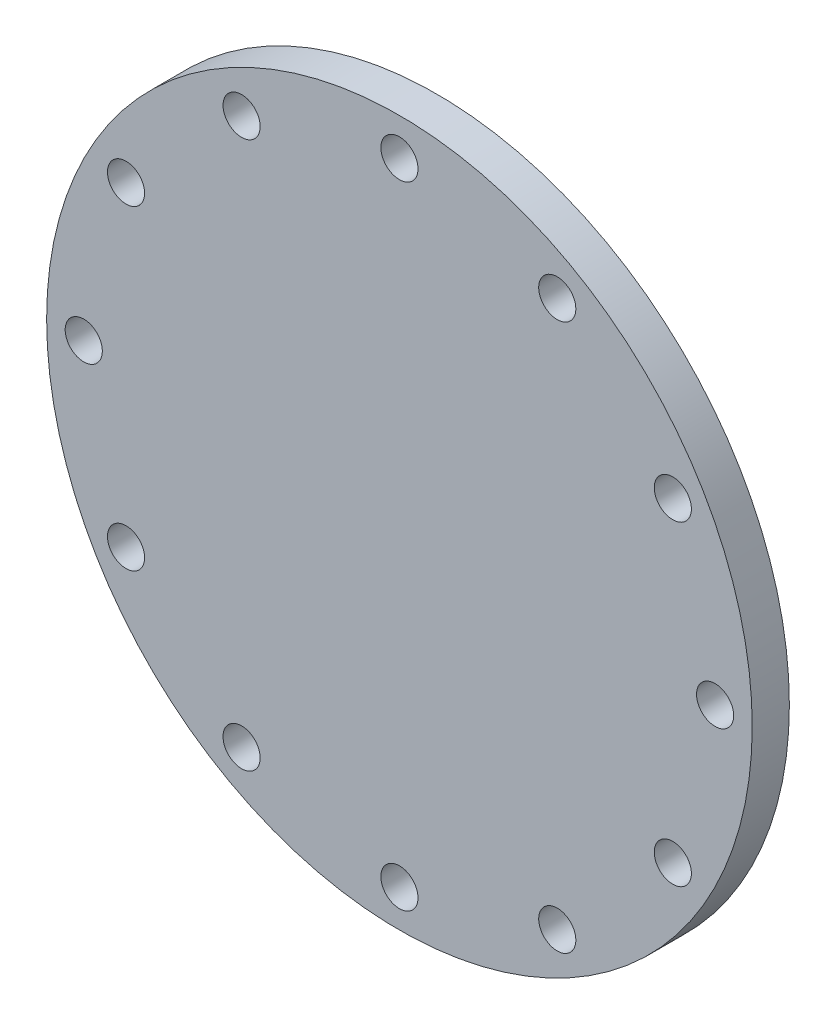
ISO-10303-21;
HEADER;
FILE_DESCRIPTION(('STEP AP214'),'2;1');
FILE_NAME('part.step','',(''),(''),'','','');
FILE_SCHEMA(('AUTOMOTIVE_DESIGN { 1 0 10303 214 1 1 1 1 }'));
ENDSEC;
DATA;
#1=APPLICATION_CONTEXT('core data for automotive mechanical design processes');
#2=APPLICATION_PROTOCOL_DEFINITION('international standard','automotive_design',2000,#1);
#3=PRODUCT_CONTEXT('',#1,'mechanical');
#4=PRODUCT('Part','Part','',(#3));
#5=PRODUCT_RELATED_PRODUCT_CATEGORY('part','',(#4));
#6=PRODUCT_DEFINITION_FORMATION('','',#4);
#7=PRODUCT_DEFINITION_CONTEXT('part definition',#1,'design');
#8=PRODUCT_DEFINITION('design','',#6,#7);
#9=PRODUCT_DEFINITION_SHAPE('','',#8);
#10=(LENGTH_UNIT() NAMED_UNIT(*) SI_UNIT(.MILLI.,.METRE.));
#11=(NAMED_UNIT(*) PLANE_ANGLE_UNIT() SI_UNIT($,.RADIAN.));
#12=(NAMED_UNIT(*) SI_UNIT($,.STERADIAN.) SOLID_ANGLE_UNIT());
#13=UNCERTAINTY_MEASURE_WITH_UNIT(LENGTH_MEASURE(1.E-05),#10,'distance_accuracy_value','');
#14=(GEOMETRIC_REPRESENTATION_CONTEXT(3) GLOBAL_UNCERTAINTY_ASSIGNED_CONTEXT((#13)) GLOBAL_UNIT_ASSIGNED_CONTEXT((#10,
#11,#12)) REPRESENTATION_CONTEXT('',''));
#15=CARTESIAN_POINT('',(0.,0.,0.));
#16=DIRECTION('',(0.,0.,1.));
#17=DIRECTION('',(1.,0.,0.));
#18=AXIS2_PLACEMENT_3D('',#15,#16,#17);
#19=CARTESIAN_POINT('',(0.,0.,25.4));
#20=DIRECTION('',(0.,0.,1.));
#21=DIRECTION('',(1.,0.,0.));
#22=AXIS2_PLACEMENT_3D('',#19,#20,#21);
#23=PLANE('',#22);
#24=CARTESIAN_POINT('',(-186.974884677056,107.949999999992,25.4));
#25=DIRECTION('',(0.,0.,1.));
#26=DIRECTION('',(1.,0.,0.));
#27=AXIS2_PLACEMENT_3D('',#24,#25,#26);
#28=CIRCLE('',#27,12.7000000000093);
#29=CARTESIAN_POINT('',(-174.274884677047,107.949999999992,25.4));
#30=VERTEX_POINT('',#29);
#31=EDGE_CURVE('E106',#30,#30,#28,.T.);
#32=ORIENTED_EDGE('',*,*,#31,.F.);
#33=EDGE_LOOP('',(#32));
#34=FACE_BOUND('',#33,.T.);
#35=CARTESIAN_POINT('',(-186.974884677047,-107.950000000008,25.4));
#36=DIRECTION('',(0.,0.,1.));
#37=DIRECTION('',(1.,0.,0.));
#38=AXIS2_PLACEMENT_3D('',#35,#36,#37);
#39=CIRCLE('',#38,12.7000000000175);
#40=CARTESIAN_POINT('',(-174.274884677029,-107.950000000008,25.4));
#41=VERTEX_POINT('',#40);
#42=EDGE_CURVE('E94',#41,#41,#39,.T.);
#43=ORIENTED_EDGE('',*,*,#42,.F.);
#44=EDGE_LOOP('',(#43));
#45=FACE_BOUND('',#44,.T.);
#46=CARTESIAN_POINT('',(1.83294208248919E-11,-215.9,25.4));
#47=DIRECTION('',(0.,0.,1.));
#48=DIRECTION('',(1.,0.,0.));
#49=AXIS2_PLACEMENT_3D('',#46,#47,#48);
#50=CIRCLE('',#49,12.700000000019);
#51=CARTESIAN_POINT('',(12.7000000000373,-215.9,25.4));
#52=VERTEX_POINT('',#51);
#53=EDGE_CURVE('E82',#52,#52,#50,.T.);
#54=ORIENTED_EDGE('',*,*,#53,.F.);
#55=EDGE_LOOP('',(#54));
#56=FACE_BOUND('',#55,.T.);
#57=CARTESIAN_POINT('',(186.974884677074,-107.949999999992,25.4));
#58=DIRECTION('',(0.,0.,1.));
#59=DIRECTION('',(1.,0.,0.));
#60=AXIS2_PLACEMENT_3D('',#57,#58,#59);
#61=CIRCLE('',#60,12.7000000000118);
#62=CARTESIAN_POINT('',(199.674884677086,-107.949999999992,25.4));
#63=VERTEX_POINT('',#62);
#64=EDGE_CURVE('E70',#63,#63,#61,.T.);
#65=ORIENTED_EDGE('',*,*,#64,.F.);
#66=EDGE_LOOP('',(#65));
#67=FACE_BOUND('',#66,.T.);
#68=CARTESIAN_POINT('',(186.974884677065,107.950000000008,25.4));
#69=DIRECTION('',(0.,0.,1.));
#70=DIRECTION('',(1.,0.,0.));
#71=AXIS2_PLACEMENT_3D('',#68,#69,#70);
#72=CIRCLE('',#71,12.7000000000025);
#73=CARTESIAN_POINT('',(199.674884677067,107.950000000008,25.4));
#74=VERTEX_POINT('',#73);
#75=EDGE_CURVE('E58',#74,#74,#72,.T.);
#76=ORIENTED_EDGE('',*,*,#75,.F.);
#77=EDGE_LOOP('',(#76));
#78=FACE_BOUND('',#77,.T.);
#79=CARTESIAN_POINT('',(0.,215.9,25.4));
#80=DIRECTION('',(0.,0.,1.));
#81=DIRECTION('',(1.,0.,0.));
#82=AXIS2_PLACEMENT_3D('',#79,#80,#81);
#83=CIRCLE('',#82,12.7);
#84=CARTESIAN_POINT('',(12.7,215.9,25.4));
#85=VERTEX_POINT('',#84);
#86=EDGE_CURVE('E47',#85,#85,#83,.T.);
#87=ORIENTED_EDGE('',*,*,#86,.F.);
#88=EDGE_LOOP('',(#87));
#89=FACE_BOUND('',#88,.T.);
#90=CARTESIAN_POINT('',(0.,0.,25.4));
#91=DIRECTION('',(0.,0.,1.));
#92=DIRECTION('',(1.,0.,0.));
#93=AXIS2_PLACEMENT_3D('',#90,#91,#92);
#94=CIRCLE('',#93,241.3);
#95=CARTESIAN_POINT('',(241.3,0.,25.4));
#96=VERTEX_POINT('',#95);
#97=EDGE_CURVE('E10',#96,#96,#94,.T.);
#98=ORIENTED_EDGE('',*,*,#97,.T.);
#99=EDGE_LOOP('',(#98));
#100=FACE_BOUND('',#99,.T.);
#101=CARTESIAN_POINT('',(107.95,186.97488467706,25.4));
#102=DIRECTION('',(0.,0.,1.));
#103=DIRECTION('',(1.,0.,0.));
#104=AXIS2_PLACEMENT_3D('',#101,#102,#103);
#105=CIRCLE('',#104,12.7);
#106=CARTESIAN_POINT('',(120.65,186.97488467706,25.4));
#107=VERTEX_POINT('',#106);
#108=EDGE_CURVE('E52',#107,#107,#105,.T.);
#109=ORIENTED_EDGE('',*,*,#108,.F.);
#110=EDGE_LOOP('',(#109));
#111=FACE_BOUND('',#110,.T.);
#112=CARTESIAN_POINT('',(215.900000000009,9.16471041244595E-12,25.4));
#113=DIRECTION('',(0.,0.,1.));
#114=DIRECTION('',(1.,0.,0.));
#115=AXIS2_PLACEMENT_3D('',#112,#113,#114);
#116=CIRCLE('',#115,12.7000000000068);
#117=CARTESIAN_POINT('',(228.600000000016,9.16471041244595E-12,25.4));
#118=VERTEX_POINT('',#117);
#119=EDGE_CURVE('E64',#118,#118,#116,.T.);
#120=ORIENTED_EDGE('',*,*,#119,.F.);
#121=EDGE_LOOP('',(#120));
#122=FACE_BOUND('',#121,.T.);
#123=CARTESIAN_POINT('',(107.950000000017,-186.974884677056,25.4));
#124=DIRECTION('',(0.,0.,1.));
#125=DIRECTION('',(1.,0.,0.));
#126=AXIS2_PLACEMENT_3D('',#123,#124,#125);
#127=CIRCLE('',#126,12.7000000000163);
#128=CARTESIAN_POINT('',(120.650000000033,-186.974884677056,25.4));
#129=VERTEX_POINT('',#128);
#130=EDGE_CURVE('E76',#129,#129,#127,.T.);
#131=ORIENTED_EDGE('',*,*,#130,.F.);
#132=EDGE_LOOP('',(#131));
#133=FACE_BOUND('',#132,.T.);
#134=CARTESIAN_POINT('',(-107.949999999983,-186.974884677065,25.4));
#135=DIRECTION('',(0.,0.,1.));
#136=DIRECTION('',(1.,0.,0.));
#137=AXIS2_PLACEMENT_3D('',#134,#135,#136);
#138=CIRCLE('',#137,12.7000000000194);
#139=CARTESIAN_POINT('',(-95.2499999999634,-186.974884677065,25.4));
#140=VERTEX_POINT('',#139);
#141=EDGE_CURVE('E88',#140,#140,#138,.T.);
#142=ORIENTED_EDGE('',*,*,#141,.F.);
#143=EDGE_LOOP('',(#142));
#144=FACE_BOUND('',#143,.T.);
#145=CARTESIAN_POINT('',(-215.899999999991,-9.19115053683954E-12,25.4));
#146=DIRECTION('',(0.,0.,1.));
#147=DIRECTION('',(1.,0.,0.));
#148=AXIS2_PLACEMENT_3D('',#145,#146,#147);
#149=CIRCLE('',#148,12.7000000000136);
#150=CARTESIAN_POINT('',(-203.199999999977,-9.19115053683954E-12,25.4));
#151=VERTEX_POINT('',#150);
#152=EDGE_CURVE('E100',#151,#151,#149,.T.);
#153=ORIENTED_EDGE('',*,*,#152,.F.);
#154=EDGE_LOOP('',(#153));
#155=FACE_BOUND('',#154,.T.);
#156=CARTESIAN_POINT('',(-107.949999999999,186.974884677056,25.4));
#157=DIRECTION('',(0.,0.,1.));
#158=DIRECTION('',(1.,0.,0.));
#159=AXIS2_PLACEMENT_3D('',#156,#157,#158);
#160=CIRCLE('',#159,12.7000000000053);
#161=CARTESIAN_POINT('',(-95.2499999999936,186.974884677056,25.4));
#162=VERTEX_POINT('',#161);
#163=EDGE_CURVE('E112',#162,#162,#160,.T.);
#164=ORIENTED_EDGE('',*,*,#163,.F.);
#165=EDGE_LOOP('',(#164));
#166=FACE_BOUND('',#165,.T.);
#167=ADVANCED_FACE('F36',(#34,#45,#56,#67,#78,#89,#100,#111,#122,#133,#144,#155,#166),#23,.T.);
#168=CARTESIAN_POINT('',(0.,0.,0.));
#169=DIRECTION('',(0.,0.,1.));
#170=DIRECTION('',(1.,0.,0.));
#171=AXIS2_PLACEMENT_3D('',#168,#169,#170);
#172=PLANE('',#171);
#173=CARTESIAN_POINT('',(0.,0.,0.));
#174=DIRECTION('',(0.,0.,1.));
#175=DIRECTION('',(1.,0.,0.));
#176=AXIS2_PLACEMENT_3D('',#173,#174,#175);
#177=CIRCLE('',#176,241.3);
#178=CARTESIAN_POINT('',(241.3,0.,0.));
#179=VERTEX_POINT('',#178);
#180=EDGE_CURVE('E40',#179,#179,#177,.T.);
#181=ORIENTED_EDGE('',*,*,#180,.F.);
#182=EDGE_LOOP('',(#181));
#183=FACE_BOUND('',#182,.T.);
#184=CARTESIAN_POINT('',(0.,215.9,0.));
#185=DIRECTION('',(0.,0.,1.));
#186=DIRECTION('',(1.,0.,0.));
#187=AXIS2_PLACEMENT_3D('',#184,#185,#186);
#188=CIRCLE('',#187,12.7);
#189=CARTESIAN_POINT('',(12.7,215.9,0.));
#190=VERTEX_POINT('',#189);
#191=EDGE_CURVE('E49',#190,#190,#188,.T.);
#192=ORIENTED_EDGE('',*,*,#191,.T.);
#193=EDGE_LOOP('',(#192));
#194=FACE_BOUND('',#193,.T.);
#195=CARTESIAN_POINT('',(107.95,186.97488467706,0.));
#196=DIRECTION('',(0.,0.,1.));
#197=DIRECTION('',(1.,0.,0.));
#198=AXIS2_PLACEMENT_3D('',#195,#196,#197);
#199=CIRCLE('',#198,12.7);
#200=CARTESIAN_POINT('',(120.65,186.97488467706,0.));
#201=VERTEX_POINT('',#200);
#202=EDGE_CURVE('E55',#201,#201,#199,.T.);
#203=ORIENTED_EDGE('',*,*,#202,.T.);
#204=EDGE_LOOP('',(#203));
#205=FACE_BOUND('',#204,.T.);
#206=CARTESIAN_POINT('',(186.974884677065,107.950000000008,0.));
#207=DIRECTION('',(0.,0.,1.));
#208=DIRECTION('',(1.,0.,0.));
#209=AXIS2_PLACEMENT_3D('',#206,#207,#208);
#210=CIRCLE('',#209,12.7000000000025);
#211=CARTESIAN_POINT('',(199.674884677067,107.950000000008,0.));
#212=VERTEX_POINT('',#211);
#213=EDGE_CURVE('E61',#212,#212,#210,.T.);
#214=ORIENTED_EDGE('',*,*,#213,.T.);
#215=EDGE_LOOP('',(#214));
#216=FACE_BOUND('',#215,.T.);
#217=CARTESIAN_POINT('',(215.900000000009,9.16471041244595E-12,0.));
#218=DIRECTION('',(0.,0.,1.));
#219=DIRECTION('',(1.,0.,0.));
#220=AXIS2_PLACEMENT_3D('',#217,#218,#219);
#221=CIRCLE('',#220,12.7000000000068);
#222=CARTESIAN_POINT('',(228.600000000016,9.16471041244595E-12,0.));
#223=VERTEX_POINT('',#222);
#224=EDGE_CURVE('E67',#223,#223,#221,.T.);
#225=ORIENTED_EDGE('',*,*,#224,.T.);
#226=EDGE_LOOP('',(#225));
#227=FACE_BOUND('',#226,.T.);
#228=CARTESIAN_POINT('',(186.974884677074,-107.949999999992,0.));
#229=DIRECTION('',(0.,0.,1.));
#230=DIRECTION('',(1.,0.,0.));
#231=AXIS2_PLACEMENT_3D('',#228,#229,#230);
#232=CIRCLE('',#231,12.7000000000118);
#233=CARTESIAN_POINT('',(199.674884677086,-107.949999999992,0.));
#234=VERTEX_POINT('',#233);
#235=EDGE_CURVE('E73',#234,#234,#232,.T.);
#236=ORIENTED_EDGE('',*,*,#235,.T.);
#237=EDGE_LOOP('',(#236));
#238=FACE_BOUND('',#237,.T.);
#239=CARTESIAN_POINT('',(107.950000000017,-186.974884677056,0.));
#240=DIRECTION('',(0.,0.,1.));
#241=DIRECTION('',(1.,0.,0.));
#242=AXIS2_PLACEMENT_3D('',#239,#240,#241);
#243=CIRCLE('',#242,12.7000000000163);
#244=CARTESIAN_POINT('',(120.650000000033,-186.974884677056,0.));
#245=VERTEX_POINT('',#244);
#246=EDGE_CURVE('E79',#245,#245,#243,.T.);
#247=ORIENTED_EDGE('',*,*,#246,.T.);
#248=EDGE_LOOP('',(#247));
#249=FACE_BOUND('',#248,.T.);
#250=CARTESIAN_POINT('',(1.83294208248919E-11,-215.9,0.));
#251=DIRECTION('',(0.,0.,1.));
#252=DIRECTION('',(1.,0.,0.));
#253=AXIS2_PLACEMENT_3D('',#250,#251,#252);
#254=CIRCLE('',#253,12.700000000019);
#255=CARTESIAN_POINT('',(12.7000000000373,-215.9,0.));
#256=VERTEX_POINT('',#255);
#257=EDGE_CURVE('E85',#256,#256,#254,.T.);
#258=ORIENTED_EDGE('',*,*,#257,.T.);
#259=EDGE_LOOP('',(#258));
#260=FACE_BOUND('',#259,.T.);
#261=CARTESIAN_POINT('',(-107.949999999983,-186.974884677065,0.));
#262=DIRECTION('',(0.,0.,1.));
#263=DIRECTION('',(1.,0.,0.));
#264=AXIS2_PLACEMENT_3D('',#261,#262,#263);
#265=CIRCLE('',#264,12.7000000000194);
#266=CARTESIAN_POINT('',(-95.2499999999634,-186.974884677065,0.));
#267=VERTEX_POINT('',#266);
#268=EDGE_CURVE('E91',#267,#267,#265,.T.);
#269=ORIENTED_EDGE('',*,*,#268,.T.);
#270=EDGE_LOOP('',(#269));
#271=FACE_BOUND('',#270,.T.);
#272=CARTESIAN_POINT('',(-186.974884677047,-107.950000000008,0.));
#273=DIRECTION('',(0.,0.,1.));
#274=DIRECTION('',(1.,0.,0.));
#275=AXIS2_PLACEMENT_3D('',#272,#273,#274);
#276=CIRCLE('',#275,12.7000000000175);
#277=CARTESIAN_POINT('',(-174.274884677029,-107.950000000008,0.));
#278=VERTEX_POINT('',#277);
#279=EDGE_CURVE('E97',#278,#278,#276,.T.);
#280=ORIENTED_EDGE('',*,*,#279,.T.);
#281=EDGE_LOOP('',(#280));
#282=FACE_BOUND('',#281,.T.);
#283=CARTESIAN_POINT('',(-215.899999999991,-9.19115053683954E-12,0.));
#284=DIRECTION('',(0.,0.,1.));
#285=DIRECTION('',(1.,0.,0.));
#286=AXIS2_PLACEMENT_3D('',#283,#284,#285);
#287=CIRCLE('',#286,12.7000000000136);
#288=CARTESIAN_POINT('',(-203.199999999977,-9.19115053683954E-12,0.));
#289=VERTEX_POINT('',#288);
#290=EDGE_CURVE('E103',#289,#289,#287,.T.);
#291=ORIENTED_EDGE('',*,*,#290,.T.);
#292=EDGE_LOOP('',(#291));
#293=FACE_BOUND('',#292,.T.);
#294=CARTESIAN_POINT('',(-186.974884677056,107.949999999992,0.));
#295=DIRECTION('',(0.,0.,1.));
#296=DIRECTION('',(1.,0.,0.));
#297=AXIS2_PLACEMENT_3D('',#294,#295,#296);
#298=CIRCLE('',#297,12.7000000000093);
#299=CARTESIAN_POINT('',(-174.274884677047,107.949999999992,0.));
#300=VERTEX_POINT('',#299);
#301=EDGE_CURVE('E109',#300,#300,#298,.T.);
#302=ORIENTED_EDGE('',*,*,#301,.T.);
#303=EDGE_LOOP('',(#302));
#304=FACE_BOUND('',#303,.T.);
#305=CARTESIAN_POINT('',(-107.949999999999,186.974884677056,0.));
#306=DIRECTION('',(0.,0.,1.));
#307=DIRECTION('',(1.,0.,0.));
#308=AXIS2_PLACEMENT_3D('',#305,#306,#307);
#309=CIRCLE('',#308,12.7000000000053);
#310=CARTESIAN_POINT('',(-95.2499999999936,186.974884677056,0.));
#311=VERTEX_POINT('',#310);
#312=EDGE_CURVE('E115',#311,#311,#309,.T.);
#313=ORIENTED_EDGE('',*,*,#312,.T.);
#314=EDGE_LOOP('',(#313));
#315=FACE_BOUND('',#314,.T.);
#316=ADVANCED_FACE('F125',(#183,#194,#205,#216,#227,#238,#249,#260,#271,#282,#293,#304,#315),
#172,.F.);
#317=CARTESIAN_POINT('',(0.,0.,25.4));
#318=DIRECTION('',(0.,0.,-1.));
#319=DIRECTION('',(-1.,0.,0.));
#320=AXIS2_PLACEMENT_3D('',#317,#318,#319);
#321=CYLINDRICAL_SURFACE('',#320,241.3);
#322=ORIENTED_EDGE('',*,*,#97,.F.);
#323=EDGE_LOOP('',(#322));
#324=FACE_BOUND('',#323,.T.);
#325=ORIENTED_EDGE('',*,*,#180,.T.);
#326=EDGE_LOOP('',(#325));
#327=FACE_BOUND('',#326,.T.);
#328=ADVANCED_FACE('F38',(#324,#327),#321,.T.);
#329=CARTESIAN_POINT('',(0.,215.9,25.4));
#330=DIRECTION('',(0.,0.,-1.));
#331=DIRECTION('',(-1.,0.,0.));
#332=AXIS2_PLACEMENT_3D('',#329,#330,#331);
#333=CYLINDRICAL_SURFACE('',#332,12.7);
#334=ORIENTED_EDGE('',*,*,#86,.T.);
#335=EDGE_LOOP('',(#334));
#336=FACE_BOUND('',#335,.T.);
#337=ORIENTED_EDGE('',*,*,#191,.F.);
#338=EDGE_LOOP('',(#337));
#339=FACE_BOUND('',#338,.T.);
#340=ADVANCED_FACE('F135',(#336,#339),#333,.F.);
#341=CARTESIAN_POINT('',(107.95,186.97488467706,25.4));
#342=DIRECTION('',(0.,0.,-1.));
#343=DIRECTION('',(-1.,0.,0.));
#344=AXIS2_PLACEMENT_3D('',#341,#342,#343);
#345=CYLINDRICAL_SURFACE('',#344,12.7);
#346=ORIENTED_EDGE('',*,*,#108,.T.);
#347=EDGE_LOOP('',(#346));
#348=FACE_BOUND('',#347,.T.);
#349=ORIENTED_EDGE('',*,*,#202,.F.);
#350=EDGE_LOOP('',(#349));
#351=FACE_BOUND('',#350,.T.);
#352=ADVANCED_FACE('F138',(#348,#351),#345,.F.);
#353=CARTESIAN_POINT('',(186.974884677065,107.950000000008,25.4));
#354=DIRECTION('',(0.,0.,-1.));
#355=DIRECTION('',(-1.,0.,0.));
#356=AXIS2_PLACEMENT_3D('',#353,#354,#355);
#357=CYLINDRICAL_SURFACE('',#356,12.7000000000025);
#358=ORIENTED_EDGE('',*,*,#75,.T.);
#359=EDGE_LOOP('',(#358));
#360=FACE_BOUND('',#359,.T.);
#361=ORIENTED_EDGE('',*,*,#213,.F.);
#362=EDGE_LOOP('',(#361));
#363=FACE_BOUND('',#362,.T.);
#364=ADVANCED_FACE('F142',(#360,#363),#357,.F.);
#365=CARTESIAN_POINT('',(215.900000000009,9.16471041244595E-12,25.4));
#366=DIRECTION('',(0.,0.,-1.));
#367=DIRECTION('',(-1.,0.,0.));
#368=AXIS2_PLACEMENT_3D('',#365,#366,#367);
#369=CYLINDRICAL_SURFACE('',#368,12.7000000000068);
#370=ORIENTED_EDGE('',*,*,#119,.T.);
#371=EDGE_LOOP('',(#370));
#372=FACE_BOUND('',#371,.T.);
#373=ORIENTED_EDGE('',*,*,#224,.F.);
#374=EDGE_LOOP('',(#373));
#375=FACE_BOUND('',#374,.T.);
#376=ADVANCED_FACE('F146',(#372,#375),#369,.F.);
#377=CARTESIAN_POINT('',(186.974884677074,-107.949999999992,25.4));
#378=DIRECTION('',(0.,0.,-1.));
#379=DIRECTION('',(-1.,0.,0.));
#380=AXIS2_PLACEMENT_3D('',#377,#378,#379);
#381=CYLINDRICAL_SURFACE('',#380,12.7000000000118);
#382=ORIENTED_EDGE('',*,*,#64,.T.);
#383=EDGE_LOOP('',(#382));
#384=FACE_BOUND('',#383,.T.);
#385=ORIENTED_EDGE('',*,*,#235,.F.);
#386=EDGE_LOOP('',(#385));
#387=FACE_BOUND('',#386,.T.);
#388=ADVANCED_FACE('F150',(#384,#387),#381,.F.);
#389=CARTESIAN_POINT('',(107.950000000017,-186.974884677056,25.4));
#390=DIRECTION('',(0.,0.,-1.));
#391=DIRECTION('',(-1.,0.,0.));
#392=AXIS2_PLACEMENT_3D('',#389,#390,#391);
#393=CYLINDRICAL_SURFACE('',#392,12.7000000000163);
#394=ORIENTED_EDGE('',*,*,#130,.T.);
#395=EDGE_LOOP('',(#394));
#396=FACE_BOUND('',#395,.T.);
#397=ORIENTED_EDGE('',*,*,#246,.F.);
#398=EDGE_LOOP('',(#397));
#399=FACE_BOUND('',#398,.T.);
#400=ADVANCED_FACE('F154',(#396,#399),#393,.F.);
#401=CARTESIAN_POINT('',(1.83294208248919E-11,-215.9,25.4));
#402=DIRECTION('',(0.,0.,-1.));
#403=DIRECTION('',(-1.,0.,0.));
#404=AXIS2_PLACEMENT_3D('',#401,#402,#403);
#405=CYLINDRICAL_SURFACE('',#404,12.700000000019);
#406=ORIENTED_EDGE('',*,*,#53,.T.);
#407=EDGE_LOOP('',(#406));
#408=FACE_BOUND('',#407,.T.);
#409=ORIENTED_EDGE('',*,*,#257,.F.);
#410=EDGE_LOOP('',(#409));
#411=FACE_BOUND('',#410,.T.);
#412=ADVANCED_FACE('F158',(#408,#411),#405,.F.);
#413=CARTESIAN_POINT('',(-107.949999999983,-186.974884677065,25.4));
#414=DIRECTION('',(0.,0.,-1.));
#415=DIRECTION('',(-1.,0.,0.));
#416=AXIS2_PLACEMENT_3D('',#413,#414,#415);
#417=CYLINDRICAL_SURFACE('',#416,12.7000000000194);
#418=ORIENTED_EDGE('',*,*,#141,.T.);
#419=EDGE_LOOP('',(#418));
#420=FACE_BOUND('',#419,.T.);
#421=ORIENTED_EDGE('',*,*,#268,.F.);
#422=EDGE_LOOP('',(#421));
#423=FACE_BOUND('',#422,.T.);
#424=ADVANCED_FACE('F162',(#420,#423),#417,.F.);
#425=CARTESIAN_POINT('',(-186.974884677047,-107.950000000008,25.4));
#426=DIRECTION('',(0.,0.,-1.));
#427=DIRECTION('',(-1.,0.,0.));
#428=AXIS2_PLACEMENT_3D('',#425,#426,#427);
#429=CYLINDRICAL_SURFACE('',#428,12.7000000000175);
#430=ORIENTED_EDGE('',*,*,#42,.T.);
#431=EDGE_LOOP('',(#430));
#432=FACE_BOUND('',#431,.T.);
#433=ORIENTED_EDGE('',*,*,#279,.F.);
#434=EDGE_LOOP('',(#433));
#435=FACE_BOUND('',#434,.T.);
#436=ADVANCED_FACE('F166',(#432,#435),#429,.F.);
#437=CARTESIAN_POINT('',(-215.899999999991,-9.19115053683954E-12,25.4));
#438=DIRECTION('',(0.,0.,-1.));
#439=DIRECTION('',(-1.,0.,0.));
#440=AXIS2_PLACEMENT_3D('',#437,#438,#439);
#441=CYLINDRICAL_SURFACE('',#440,12.7000000000136);
#442=ORIENTED_EDGE('',*,*,#152,.T.);
#443=EDGE_LOOP('',(#442));
#444=FACE_BOUND('',#443,.T.);
#445=ORIENTED_EDGE('',*,*,#290,.F.);
#446=EDGE_LOOP('',(#445));
#447=FACE_BOUND('',#446,.T.);
#448=ADVANCED_FACE('F170',(#444,#447),#441,.F.);
#449=CARTESIAN_POINT('',(-186.974884677056,107.949999999992,25.4));
#450=DIRECTION('',(0.,0.,-1.));
#451=DIRECTION('',(-1.,0.,0.));
#452=AXIS2_PLACEMENT_3D('',#449,#450,#451);
#453=CYLINDRICAL_SURFACE('',#452,12.7000000000093);
#454=ORIENTED_EDGE('',*,*,#31,.T.);
#455=EDGE_LOOP('',(#454));
#456=FACE_BOUND('',#455,.T.);
#457=ORIENTED_EDGE('',*,*,#301,.F.);
#458=EDGE_LOOP('',(#457));
#459=FACE_BOUND('',#458,.T.);
#460=ADVANCED_FACE('F174',(#456,#459),#453,.F.);
#461=CARTESIAN_POINT('',(-107.949999999999,186.974884677056,25.4));
#462=DIRECTION('',(0.,0.,-1.));
#463=DIRECTION('',(-1.,0.,0.));
#464=AXIS2_PLACEMENT_3D('',#461,#462,#463);
#465=CYLINDRICAL_SURFACE('',#464,12.7000000000053);
#466=ORIENTED_EDGE('',*,*,#163,.T.);
#467=EDGE_LOOP('',(#466));
#468=FACE_BOUND('',#467,.T.);
#469=ORIENTED_EDGE('',*,*,#312,.F.);
#470=EDGE_LOOP('',(#469));
#471=FACE_BOUND('',#470,.T.);
#472=ADVANCED_FACE('F121',(#468,#471),#465,.F.);
#473=CLOSED_SHELL('',(#167,#316,#328,#340,#352,#364,#376,#388,#400,#412,#424,#436,#448,#460,#472));
#474=MANIFOLD_SOLID_BREP('B2',#473);
#475=ADVANCED_BREP_SHAPE_REPRESENTATION('',(#18,#474),#14);
#476=SHAPE_DEFINITION_REPRESENTATION(#9,#475);
ENDSEC;
END-ISO-10303-21;
